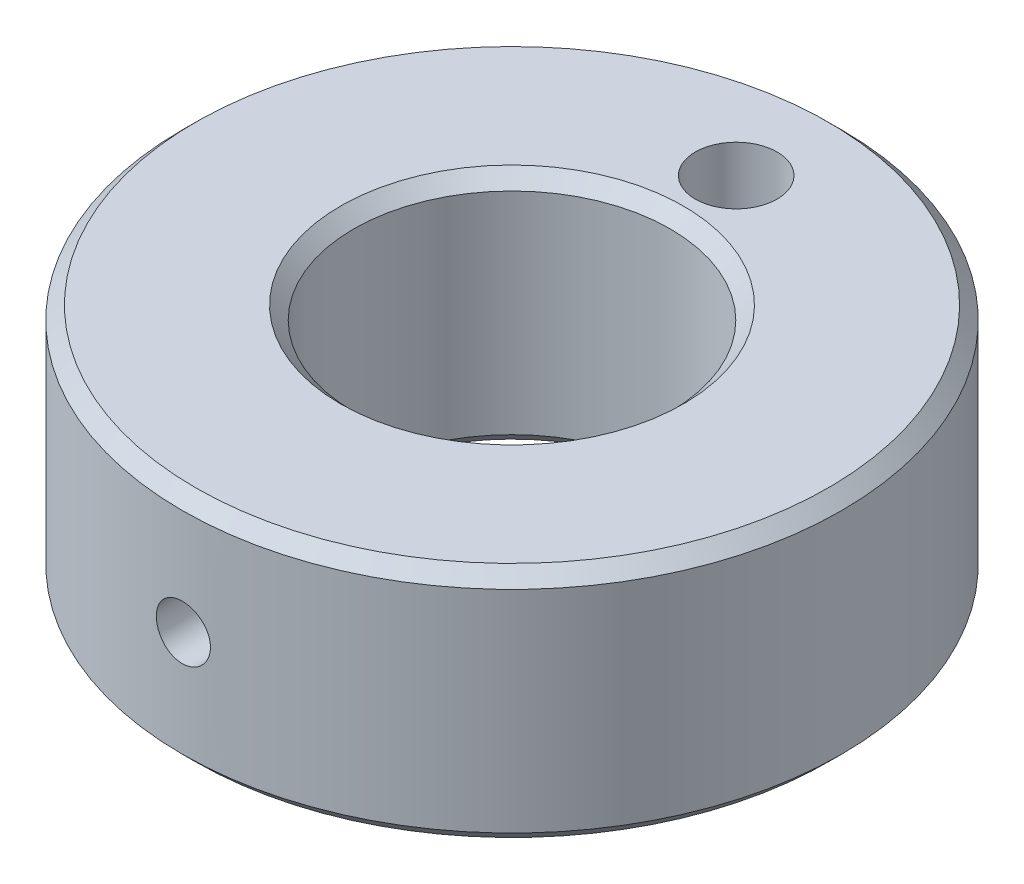
ISO-10303-21;
HEADER;
FILE_DESCRIPTION(('STEP AP214'),'2;1');
FILE_NAME('part.step','',(''),(''),'','','');
FILE_SCHEMA(('AUTOMOTIVE_DESIGN { 1 0 10303 214 1 1 1 1 }'));
ENDSEC;
DATA;
#1=APPLICATION_CONTEXT('core data for automotive mechanical design processes');
#2=APPLICATION_PROTOCOL_DEFINITION('international standard','automotive_design',2000,#1);
#3=PRODUCT_CONTEXT('',#1,'mechanical');
#4=PRODUCT('Part','Part','',(#3));
#5=PRODUCT_RELATED_PRODUCT_CATEGORY('part','',(#4));
#6=PRODUCT_DEFINITION_FORMATION('','',#4);
#7=PRODUCT_DEFINITION_CONTEXT('part definition',#1,'design');
#8=PRODUCT_DEFINITION('design','',#6,#7);
#9=PRODUCT_DEFINITION_SHAPE('','',#8);
#10=(LENGTH_UNIT() NAMED_UNIT(*) SI_UNIT(.MILLI.,.METRE.));
#11=(NAMED_UNIT(*) PLANE_ANGLE_UNIT() SI_UNIT($,.RADIAN.));
#12=(NAMED_UNIT(*) SI_UNIT($,.STERADIAN.) SOLID_ANGLE_UNIT());
#13=UNCERTAINTY_MEASURE_WITH_UNIT(LENGTH_MEASURE(1.E-05),#10,'distance_accuracy_value','');
#14=(GEOMETRIC_REPRESENTATION_CONTEXT(3) GLOBAL_UNCERTAINTY_ASSIGNED_CONTEXT((#13)) GLOBAL_UNIT_ASSIGNED_CONTEXT((#10,
#11,#12)) REPRESENTATION_CONTEXT('',''));
#15=CARTESIAN_POINT('',(0.,0.,0.));
#16=DIRECTION('',(0.,0.,1.));
#17=DIRECTION('',(1.,0.,0.));
#18=AXIS2_PLACEMENT_3D('',#15,#16,#17);
#19=CARTESIAN_POINT('',(0.,9.,0.));
#20=DIRECTION('',(0.,1.,0.));
#21=DIRECTION('',(0.,0.,1.));
#22=AXIS2_PLACEMENT_3D('',#19,#20,#21);
#23=PLANE('',#22);
#24=CARTESIAN_POINT('',(0.,9.,-8.5));
#25=DIRECTION('',(0.,1.,0.));
#26=DIRECTION('',(0.,0.,1.));
#27=AXIS2_PLACEMENT_3D('',#24,#25,#26);
#28=CIRCLE('',#27,1.55);
#29=CARTESIAN_POINT('',(0.,9.,-6.95));
#30=VERTEX_POINT('',#29);
#31=EDGE_CURVE('E63',#30,#30,#28,.T.);
#32=ORIENTED_EDGE('',*,*,#31,.F.);
#33=EDGE_LOOP('',(#32));
#34=FACE_BOUND('',#33,.T.);
#35=CARTESIAN_POINT('',(0.,9.,0.));
#36=DIRECTION('',(0.,1.,0.));
#37=DIRECTION('',(0.,0.,1.));
#38=AXIS2_PLACEMENT_3D('',#35,#36,#37);
#39=CIRCLE('',#38,6.50000000000001);
#40=CARTESIAN_POINT('',(0.,9.,6.50000000000001));
#41=VERTEX_POINT('',#40);
#42=EDGE_CURVE('E11',#41,#41,#39,.F.);
#43=ORIENTED_EDGE('',*,*,#42,.T.);
#44=EDGE_LOOP('',(#43));
#45=FACE_BOUND('',#44,.T.);
#46=CARTESIAN_POINT('',(0.,9.,0.));
#47=DIRECTION('',(0.,1.,0.));
#48=DIRECTION('',(0.,0.,1.));
#49=AXIS2_PLACEMENT_3D('',#46,#47,#48);
#50=CIRCLE('',#49,12.);
#51=CARTESIAN_POINT('',(0.,9.,12.));
#52=VERTEX_POINT('',#51);
#53=EDGE_CURVE('E49',#52,#52,#50,.T.);
#54=ORIENTED_EDGE('',*,*,#53,.T.);
#55=EDGE_LOOP('',(#54));
#56=FACE_BOUND('',#55,.T.);
#57=ADVANCED_FACE('F42',(#34,#45,#56),#23,.T.);
#58=CARTESIAN_POINT('',(0.,0.,0.));
#59=DIRECTION('',(0.,1.,0.));
#60=DIRECTION('',(0.,0.,1.));
#61=AXIS2_PLACEMENT_3D('',#58,#59,#60);
#62=PLANE('',#61);
#63=CARTESIAN_POINT('',(0.,0.,0.));
#64=DIRECTION('',(0.,1.,0.));
#65=DIRECTION('',(0.,0.,1.));
#66=AXIS2_PLACEMENT_3D('',#63,#64,#65);
#67=CIRCLE('',#66,6.5);
#68=CARTESIAN_POINT('',(0.,0.,6.5));
#69=VERTEX_POINT('',#68);
#70=EDGE_CURVE('E130',#69,#69,#67,.T.);
#71=ORIENTED_EDGE('',*,*,#70,.T.);
#72=EDGE_LOOP('',(#71));
#73=FACE_BOUND('',#72,.T.);
#74=CARTESIAN_POINT('',(0.,0.,0.));
#75=DIRECTION('',(0.,1.,0.));
#76=DIRECTION('',(0.,0.,1.));
#77=AXIS2_PLACEMENT_3D('',#74,#75,#76);
#78=CIRCLE('',#77,12.);
#79=CARTESIAN_POINT('',(0.,0.,12.));
#80=VERTEX_POINT('',#79);
#81=EDGE_CURVE('E136',#80,#80,#78,.F.);
#82=ORIENTED_EDGE('',*,*,#81,.T.);
#83=EDGE_LOOP('',(#82));
#84=FACE_BOUND('',#83,.T.);
#85=ADVANCED_FACE('F93',(#73,#84),#62,.F.);
#86=CARTESIAN_POINT('',(0.,9.,0.));
#87=DIRECTION('',(0.,-1.,0.));
#88=DIRECTION('',(0.,0.,-1.));
#89=AXIS2_PLACEMENT_3D('',#86,#87,#88);
#90=CYLINDRICAL_SURFACE('',#89,12.5);
#91=CARTESIAN_POINT('',(1.02499999999999,4.50000000000001,12.457904117467));
#92=CARTESIAN_POINT('',(1.02499748803659,4.44252923768061,12.4579046755874));
#93=CARTESIAN_POINT('',(1.02015024492621,4.38501926916881,12.4583060843747));
#94=CARTESIAN_POINT('',(1.00088489570387,4.27159032255661,12.459868346834));
#95=CARTESIAN_POINT('',(0.986455923557125,4.21567322599984,12.4610300627007));
#96=CARTESIAN_POINT('',(0.948447016894179,4.10708928714128,12.463980481196));
#97=CARTESIAN_POINT('',(0.924872244346381,4.05442063079178,12.4657688300924));
#98=CARTESIAN_POINT('',(0.869250061697745,3.95380058800745,12.4697705695876));
#99=CARTESIAN_POINT('',(0.837204472258332,3.90584819092618,12.4719838688224));
#100=CARTESIAN_POINT('',(0.765464032348409,3.81588983296292,12.4765923160778));
#101=CARTESIAN_POINT('',(0.725752453632445,3.77389723141584,12.4789878547134));
#102=CARTESIAN_POINT('',(0.63984265006064,3.69716522480346,12.483687282687));
#103=CARTESIAN_POINT('',(0.593644142897647,3.66242613557029,12.4859911680307));
#104=CARTESIAN_POINT('',(0.495992437660146,3.60114300532084,12.4902513859797));
#105=CARTESIAN_POINT('',(0.444531978823797,3.57461049695649,12.4922072278585));
#106=CARTESIAN_POINT('',(0.337867808386797,3.53056746048193,12.4955467843319));
#107=CARTESIAN_POINT('',(0.28266416047258,3.51305677891838,12.4969305086575));
#108=CARTESIAN_POINT('',(0.170213399107486,3.4875928432904,12.4989671935619));
#109=CARTESIAN_POINT('',(0.112971202631818,3.47961800950836,12.4996218039018));
#110=CARTESIAN_POINT('',(-0.00204273955899841,3.47338544040074,12.5001320924092));
#111=CARTESIAN_POINT('',(-0.0598144756886261,3.47512752952864,12.4999877850101));
#112=CARTESIAN_POINT('',(-0.174101258322397,3.48826169567366,12.4989178598958));
#113=CARTESIAN_POINT('',(-0.230618991785223,3.49963056649716,12.4979941210866));
#114=CARTESIAN_POINT('',(-0.340941316865535,3.53165949712912,12.4954714012056));
#115=CARTESIAN_POINT('',(-0.394745883359131,3.55231964295711,12.4938724138823));
#116=CARTESIAN_POINT('',(-0.498188452068122,3.60237055176716,12.4901758626451));
#117=CARTESIAN_POINT('',(-0.547821399186417,3.63177171675401,12.4880777053056));
#118=CARTESIAN_POINT('',(-0.641456656087967,3.69846251905984,12.4836186269201));
#119=CARTESIAN_POINT('',(-0.685458855314575,3.73575231122955,12.4812577007165));
#120=CARTESIAN_POINT('',(-0.766719222476191,3.81729265888459,12.4765302394767));
#121=CARTESIAN_POINT('',(-0.803957161082404,3.86156337743104,12.4741637083829));
#122=CARTESIAN_POINT('',(-0.870475694206722,3.95573859977181,12.4696987554834));
#123=CARTESIAN_POINT('',(-0.899756282463483,4.00564310799911,12.4676003338886));
#124=CARTESIAN_POINT('',(-0.949528127970764,4.10968341022951,12.4639087895095));
#125=CARTESIAN_POINT('',(-0.970018349714463,4.16381970184996,12.4623157262622));
#126=CARTESIAN_POINT('',(-1.00161291614754,4.27478012761068,12.4598164087817));
#127=CARTESIAN_POINT('',(-1.01271745181415,4.33160420703579,12.4589101405738));
#128=CARTESIAN_POINT('',(-1.02519984948027,4.44615020585159,12.4578892740534));
#129=CARTESIAN_POINT('',(-1.02660591499784,4.50386903223468,12.457772380231));
#130=CARTESIAN_POINT('',(-1.01972532438384,4.61872158213449,12.4583374378068));
#131=CARTESIAN_POINT('',(-1.01143875574694,4.67585531092814,12.4590193819939));
#132=CARTESIAN_POINT('',(-0.98543162828581,4.78783496875867,12.461103183415));
#133=CARTESIAN_POINT('',(-0.967724218839479,4.84268397197853,12.4625040371165));
#134=CARTESIAN_POINT('',(-0.923391422202269,4.94863241999835,12.4658669813908));
#135=CARTESIAN_POINT('',(-0.896765896384787,4.99973180649779,12.4678290806879));
#136=CARTESIAN_POINT('',(-0.835281250248031,5.0968595938439,12.472099000009));
#137=CARTESIAN_POINT('',(-0.800403328197875,5.14287605763247,12.4744076050318));
#138=CARTESIAN_POINT('',(-0.723431115260204,5.22841114384437,12.4791077503498));
#139=CARTESIAN_POINT('',(-0.681336704103144,5.26792965795177,12.4814992920268));
#140=CARTESIAN_POINT('',(-0.591004578114003,5.33944325465796,12.4861026684042));
#141=CARTESIAN_POINT('',(-0.5427523345424,5.37142001798386,12.4883140571549));
#142=CARTESIAN_POINT('',(-0.441546687080579,5.42681673951885,12.4923015364853));
#143=CARTESIAN_POINT('',(-0.388593328891328,5.45023678089912,12.494077631296));
#144=CARTESIAN_POINT('',(-0.279554370123788,5.48782375929719,12.4969923470561));
#145=CARTESIAN_POINT('',(-0.223472702912803,5.50200204388111,12.498131749527));
#146=CARTESIAN_POINT('',(-0.109715077102332,5.52074013031056,12.4996478699403));
#147=CARTESIAN_POINT('',(-0.0520391476464359,5.52530010786396,12.5000246018153));
#148=CARTESIAN_POINT('',(0.0630891663408579,5.52467011756891,12.4999729566683));
#149=CARTESIAN_POINT('',(0.12054171036302,5.51950870792601,12.4995469378594));
#150=CARTESIAN_POINT('',(0.233761093008734,5.49964198568827,12.4979423265381));
#151=CARTESIAN_POINT('',(0.289527929283921,5.48493665979841,12.4967637329771));
#152=CARTESIAN_POINT('',(0.397794896391851,5.44640674138726,12.4937862276187));
#153=CARTESIAN_POINT('',(0.450295201825881,5.42258263676691,12.49198734901));
#154=CARTESIAN_POINT('',(0.550555496222022,5.36649474563335,12.4879705749283));
#155=CARTESIAN_POINT('',(0.598315563577056,5.33423109872336,12.4857526863864));
#156=CARTESIAN_POINT('',(0.687885751752588,5.26207282065356,12.4811391148201));
#157=CARTESIAN_POINT('',(0.72967883870007,5.22215707618357,12.4787429513704));
#158=CARTESIAN_POINT('',(0.80598876545467,5.13586538663043,12.4740469730431));
#159=CARTESIAN_POINT('',(0.840503839359891,5.08948787821901,12.4717471816569));
#160=CARTESIAN_POINT('',(0.901323133549686,4.99150185919363,12.4674997759167));
#161=CARTESIAN_POINT('',(0.927612239536814,4.93988394764331,12.465552812574));
#162=CARTESIAN_POINT('',(0.97111678047144,4.8329861069217,12.4622394708506));
#163=CARTESIAN_POINT('',(0.988342661584624,4.77771047672113,12.4608724244183));
#164=CARTESIAN_POINT('',(1.00883800385066,4.68508986723023,12.4592257642811));
#165=CARTESIAN_POINT('',(1.01489071181459,4.64834080818518,12.4587324204337));
#166=CARTESIAN_POINT('',(1.0229725178438,4.574399976599,12.4580714167763));
#167=CARTESIAN_POINT('',(1.02500162631651,4.53720820520324,12.4579037561239));
#168=CARTESIAN_POINT('',(1.02499999999999,4.50000000000001,12.457904117467));
#169=B_SPLINE_CURVE_WITH_KNOTS('',3,(#91,#92,#93,#94,#95,#96,#97,#98,#99,#100,#101,#102,#103,
#104,#105,#106,#107,#108,#109,#110,#111,#112,#113,#114,#115,#116,#117,#118,#119,#120,#121,#122,
#123,#124,#125,#126,#127,#128,#129,#130,#131,#132,#133,#134,#135,#136,#137,#138,#139,#140,#141,
#142,#143,#144,#145,#146,#147,#148,#149,#150,#151,#152,#153,#154,#155,#156,#157,#158,#159,#160,
#161,#162,#163,#164,#165,#166,#167,#168),.UNSPECIFIED.,.T.,.F.,(4,2,2,2,2,2,2,2,2,2,2,2,2,2,2,2,
2,2,2,2,2,2,2,2,2,2,2,2,2,2,2,2,2,2,2,2,2,2,4),(0.,0.172276434326406,0.344748570893414,
0.517123503994385,0.68946141804833,0.862179737327143,1.03490557553237,1.20787305277124,
1.38083758788802,1.55340995725645,1.72597920893209,1.89813364781561,2.07028968055427,
2.2426514084292,2.41501652001302,2.58788891518234,2.76076144637813,2.9336543364023,
3.10654370836727,3.27893009873215,3.45131493299031,3.62345978555843,3.79560731413598,
3.96815089478142,4.14069735130672,4.31365871146281,4.48661839039291,4.65936529731986,
4.83210904846754,5.00434612721891,5.17658344590315,5.34881155030466,5.52103680596427,
5.69374428081055,5.86649361246722,6.03955851278973,6.21242350114785,6.32396045040315,
6.43549711115725),.UNSPECIFIED.);
#170=CARTESIAN_POINT('',(1.02499999999999,4.50000000000001,12.457904117467));
#171=VERTEX_POINT('',#170);
#172=EDGE_CURVE('E66',#171,#171,#169,.T.);
#173=ORIENTED_EDGE('',*,*,#172,.T.);
#174=EDGE_LOOP('',(#173));
#175=FACE_BOUND('',#174,.T.);
#176=CARTESIAN_POINT('',(0.,0.500000000000009,0.));
#177=DIRECTION('',(0.,1.,0.));
#178=DIRECTION('',(0.,0.,1.));
#179=AXIS2_PLACEMENT_3D('',#176,#177,#178);
#180=CIRCLE('',#179,12.5);
#181=CARTESIAN_POINT('',(0.,0.500000000000009,12.5));
#182=VERTEX_POINT('',#181);
#183=EDGE_CURVE('E141',#182,#182,#180,.T.);
#184=ORIENTED_EDGE('',*,*,#183,.T.);
#185=EDGE_LOOP('',(#184));
#186=FACE_BOUND('',#185,.T.);
#187=CARTESIAN_POINT('',(0.,8.5,0.));
#188=DIRECTION('',(0.,1.,0.));
#189=DIRECTION('',(0.,0.,1.));
#190=AXIS2_PLACEMENT_3D('',#187,#188,#189);
#191=CIRCLE('',#190,12.5);
#192=CARTESIAN_POINT('',(0.,8.5,12.5));
#193=VERTEX_POINT('',#192);
#194=EDGE_CURVE('E133',#193,#193,#191,.F.);
#195=ORIENTED_EDGE('',*,*,#194,.T.);
#196=EDGE_LOOP('',(#195));
#197=FACE_BOUND('',#196,.T.);
#198=ADVANCED_FACE('F99',(#175,#186,#197),#90,.T.);
#199=CARTESIAN_POINT('',(0.,9.,0.));
#200=DIRECTION('',(0.,-1.,0.));
#201=DIRECTION('',(0.,0.,-1.));
#202=AXIS2_PLACEMENT_3D('',#199,#200,#201);
#203=CYLINDRICAL_SURFACE('',#202,6.);
#204=CARTESIAN_POINT('',(1.02499999999999,4.50000000000001,5.91179964139517));
#205=CARTESIAN_POINT('',(1.02499772273755,4.44287783502228,5.9118006896228));
#206=CARTESIAN_POINT('',(1.02020878640849,4.38572500247462,5.91263652364019));
#207=CARTESIAN_POINT('',(1.00118876994721,4.27302446278079,5.91588628969574));
#208=CARTESIAN_POINT('',(0.986949115623023,4.21747826105562,5.91830165473889));
#209=CARTESIAN_POINT('',(0.949472278424441,4.10963825093531,5.92442911939884));
#210=CARTESIAN_POINT('',(0.926242779178084,4.05734170923323,5.92814011137788));
#211=CARTESIAN_POINT('',(0.871465034162875,3.95739354578229,5.93643938471199));
#212=CARTESIAN_POINT('',(0.839917669347548,3.9097414328689,5.94102757314817));
#213=CARTESIAN_POINT('',(0.769051458261803,3.81993631648982,5.95061732521301));
#214=CARTESIAN_POINT('',(0.729663308743944,3.77783836029365,5.95562232530027));
#215=CARTESIAN_POINT('',(0.644383390235817,3.70081497669635,5.96545127024846));
#216=CARTESIAN_POINT('',(0.598491228387675,3.6658899828716,5.97027520415027));
#217=CARTESIAN_POINT('',(0.501148354614963,3.60399646242411,5.97923494624524));
#218=CARTESIAN_POINT('',(0.449664533513418,3.5770792990045,5.98336624104806));
#219=CARTESIAN_POINT('',(0.342823647005743,3.53229580858039,5.99043693442385));
#220=CARTESIAN_POINT('',(0.287466846372922,3.51442886355135,5.99337641438114));
#221=CARTESIAN_POINT('',(0.175020457039517,3.48842171538393,5.99770801620039));
#222=CARTESIAN_POINT('',(0.117952851037856,3.48018895716333,5.99911485287263));
#223=CARTESIAN_POINT('',(0.00323014323703,3.47339596227158,6.00027324327979));
#224=CARTESIAN_POINT('',(-0.0544249164070402,3.47483503637258,6.00002491496401));
#225=CARTESIAN_POINT('',(-0.168052728482633,3.48727290442138,5.99791257505742));
#226=CARTESIAN_POINT('',(-0.224036742954671,3.49817208157792,5.9960654002019));
#227=CARTESIAN_POINT('',(-0.333369424650969,3.529063775313,5.99098170760679));
#228=CARTESIAN_POINT('',(-0.386718008404009,3.54905657970686,5.98774514589299));
#229=CARTESIAN_POINT('',(-0.489560315752141,3.59766622178188,5.98021777127519));
#230=CARTESIAN_POINT('',(-0.539034370140093,3.62632387199115,5.9759219873639));
#231=CARTESIAN_POINT('',(-0.632508888595246,3.69141978814529,5.96675302263621));
#232=CARTESIAN_POINT('',(-0.676508887308801,3.7278587148681,5.96187979279935));
#233=CARTESIAN_POINT('',(-0.758375188864932,3.80803466110825,5.95202418731771));
#234=CARTESIAN_POINT('',(-0.796156182560192,3.85185876537161,5.94704121216801));
#235=CARTESIAN_POINT('',(-0.863842810037644,3.94526828016719,5.93758765653871));
#236=CARTESIAN_POINT('',(-0.893748363860349,3.99485374918728,5.93311708126178));
#237=CARTESIAN_POINT('',(-0.94485340155782,4.09848007620809,5.92519407831867));
#238=CARTESIAN_POINT('',(-0.966042209773777,4.15252630079014,5.92174290058852));
#239=CARTESIAN_POINT('',(-0.999016325356516,4.26348315678278,5.91626981101407));
#240=CARTESIAN_POINT('',(-1.01080250539021,4.32039352184843,5.91424776653253));
#241=CARTESIAN_POINT('',(-1.02451583044538,4.43469875116292,5.91188766575082));
#242=CARTESIAN_POINT('',(-1.02656476627382,4.49207858816632,5.91152880817564));
#243=CARTESIAN_POINT('',(-1.02107036175863,4.60636115211301,5.91248025775676));
#244=CARTESIAN_POINT('',(-1.01352741152511,4.66326389836523,5.91379049702949));
#245=CARTESIAN_POINT('',(-0.989167330030116,4.77458757374756,5.91791326062162));
#246=CARTESIAN_POINT('',(-0.97241254461017,4.82902255287772,5.92071568185253));
#247=CARTESIAN_POINT('',(-0.930169932122551,4.93431218319463,5.92749852633021));
#248=CARTESIAN_POINT('',(-0.90468155897152,4.98516661026113,5.93147902323616));
#249=CARTESIAN_POINT('',(-0.845409216577014,5.08239255828241,5.94021766660985));
#250=CARTESIAN_POINT('',(-0.811547412208321,5.12871597412297,5.94498296074601));
#251=CARTESIAN_POINT('',(-0.736595890800804,5.21506686302564,5.95473351967587));
#252=CARTESIAN_POINT('',(-0.695505638593732,5.25509386950836,5.95971880073612));
#253=CARTESIAN_POINT('',(-0.606723193690897,5.32816241151444,5.96941361618125));
#254=CARTESIAN_POINT('',(-0.558963589998459,5.36112259257187,5.97411953024794));
#255=CARTESIAN_POINT('',(-0.458514267682294,5.41855120033378,5.98266677755162));
#256=CARTESIAN_POINT('',(-0.405824714760057,5.44301991231662,5.98650813983247));
#257=CARTESIAN_POINT('',(-0.297249597160217,5.48264531932086,5.99287776251716));
#258=CARTESIAN_POINT('',(-0.241379748484828,5.49784408348141,5.99541194697986));
#259=CARTESIAN_POINT('',(-0.127833634558961,5.51863340905155,5.9989067697464));
#260=CARTESIAN_POINT('',(-0.0701575262427178,5.52422480283831,5.99986754436924));
#261=CARTESIAN_POINT('',(0.0445796527234015,5.52561575242231,6.00010521773331));
#262=CARTESIAN_POINT('',(0.101639218476347,5.52153891351966,5.99940337266677));
#263=CARTESIAN_POINT('',(0.21424810568143,5.50397711910949,5.99643820675396));
#264=CARTESIAN_POINT('',(0.269797436652451,5.49049222291446,5.99417489575185));
#265=CARTESIAN_POINT('',(0.377758325666925,5.45454544730464,5.98834034657507));
#266=CARTESIAN_POINT('',(0.430173645267343,5.43209458836354,5.9847707145081));
#267=CARTESIAN_POINT('',(0.530512381474414,5.3788671335058,5.97671256974527));
#268=CARTESIAN_POINT('',(0.578435567676425,5.34809011084872,5.97222400995454));
#269=CARTESIAN_POINT('',(0.669051093069712,5.27864818893177,5.96275723858921));
#270=CARTESIAN_POINT('',(0.711673698735273,5.23989299711401,5.9577737938103));
#271=CARTESIAN_POINT('',(0.789854086881956,5.15578401032146,5.9479145235891));
#272=CARTESIAN_POINT('',(0.825410211969787,5.11042867163938,5.94303872363195));
#273=CARTESIAN_POINT('',(0.888693758575786,5.01400352900526,5.93390733510362));
#274=CARTESIAN_POINT('',(0.916360666196666,4.96289353909439,5.92965665568243));
#275=CARTESIAN_POINT('',(0.962673253963567,4.85669876015844,5.92231497537174));
#276=CARTESIAN_POINT('',(0.981327852266438,4.80161796275899,5.91922282873591));
#277=CARTESIAN_POINT('',(1.00508414328106,4.70527673783933,5.91522632721028));
#278=CARTESIAN_POINT('',(1.0125404543013,4.66459621314914,5.91394855626181));
#279=CARTESIAN_POINT('',(1.02249915739839,4.58261579872781,5.91223484256437));
#280=CARTESIAN_POINT('',(1.02500164712236,4.5413159212212,5.91179888322204));
#281=CARTESIAN_POINT('',(1.02499999999999,4.50000000000001,5.91179964139517));
#282=B_SPLINE_CURVE_WITH_KNOTS('',3,(#204,#205,#206,#207,#208,#209,#210,#211,#212,#213,#214,
#215,#216,#217,#218,#219,#220,#221,#222,#223,#224,#225,#226,#227,#228,#229,#230,#231,#232,#233,
#234,#235,#236,#237,#238,#239,#240,#241,#242,#243,#244,#245,#246,#247,#248,#249,#250,#251,#252,
#253,#254,#255,#256,#257,#258,#259,#260,#261,#262,#263,#264,#265,#266,#267,#268,#269,#270,#271,
#272,#273,#274,#275,#276,#277,#278,#279,#280,#281),.UNSPECIFIED.,.T.,.F.,(4,2,2,2,2,2,2,2,2,2,2,
2,2,2,2,2,2,2,2,2,2,2,2,2,2,2,2,2,2,2,2,2,2,2,2,2,2,2,4),(0.,0.171215389553426,
0.342586327507543,0.513811116913353,0.685017779008599,0.857810873427274,1.03061440941324,
1.20450354687646,1.37838080813483,1.55057355852007,1.72275403834729,1.89314312201172,
2.06353759890374,2.23474750002439,2.40597194589833,2.57937836537162,2.75278654537563,
2.92640647578851,3.10001029049429,3.27143689727893,3.44285653222128,3.61313002846461,
3.78341417330942,3.95534496803344,4.12728849725569,4.30111621257488,4.47493808743398,
4.64796513255631,4.82097718595661,4.99178928266892,5.1626003025172,5.33320201377504,
5.50381247053062,5.67647192165771,5.84917182117659,6.02316280979796,6.19698127066765,
6.32082218235195,6.4446606529247),.UNSPECIFIED.);
#283=CARTESIAN_POINT('',(1.02499999999999,4.50000000000001,5.91179964139517));
#284=VERTEX_POINT('',#283);
#285=EDGE_CURVE('E62',#284,#284,#282,.T.);
#286=ORIENTED_EDGE('',*,*,#285,.F.);
#287=EDGE_LOOP('',(#286));
#288=FACE_BOUND('',#287,.T.);
#289=CARTESIAN_POINT('',(0.,0.499999999999997,0.));
#290=DIRECTION('',(0.,1.,0.));
#291=DIRECTION('',(0.,0.,1.));
#292=AXIS2_PLACEMENT_3D('',#289,#290,#291);
#293=CIRCLE('',#292,6.);
#294=CARTESIAN_POINT('',(0.,0.499999999999997,6.));
#295=VERTEX_POINT('',#294);
#296=EDGE_CURVE('E129',#295,#295,#293,.F.);
#297=ORIENTED_EDGE('',*,*,#296,.T.);
#298=EDGE_LOOP('',(#297));
#299=FACE_BOUND('',#298,.T.);
#300=CARTESIAN_POINT('',(0.,8.49999999999999,0.));
#301=DIRECTION('',(0.,1.,0.));
#302=DIRECTION('',(0.,0.,1.));
#303=AXIS2_PLACEMENT_3D('',#300,#301,#302);
#304=CIRCLE('',#303,6.);
#305=CARTESIAN_POINT('',(0.,8.49999999999999,6.));
#306=VERTEX_POINT('',#305);
#307=EDGE_CURVE('E127',#306,#306,#304,.T.);
#308=ORIENTED_EDGE('',*,*,#307,.T.);
#309=EDGE_LOOP('',(#308));
#310=FACE_BOUND('',#309,.T.);
#311=ADVANCED_FACE('F104',(#288,#299,#310),#203,.F.);
#312=CARTESIAN_POINT('',(0.,0.,0.));
#313=DIRECTION('',(0.,-1.,0.));
#314=DIRECTION('',(0.,0.,-1.));
#315=AXIS2_PLACEMENT_3D('',#312,#313,#314);
#316=CONICAL_SURFACE('',#315,6.5,0.785398163397446);
#317=ORIENTED_EDGE('',*,*,#296,.F.);
#318=EDGE_LOOP('',(#317));
#319=FACE_BOUND('',#318,.T.);
#320=ORIENTED_EDGE('',*,*,#70,.F.);
#321=EDGE_LOOP('',(#320));
#322=FACE_BOUND('',#321,.T.);
#323=ADVANCED_FACE('F109',(#319,#322),#316,.F.);
#324=CARTESIAN_POINT('',(0.,0.500000000000009,0.));
#325=DIRECTION('',(0.,1.,0.));
#326=DIRECTION('',(0.,0.,1.));
#327=AXIS2_PLACEMENT_3D('',#324,#325,#326);
#328=CONICAL_SURFACE('',#327,12.5,0.785398163397452);
#329=ORIENTED_EDGE('',*,*,#81,.F.);
#330=EDGE_LOOP('',(#329));
#331=FACE_BOUND('',#330,.T.);
#332=ORIENTED_EDGE('',*,*,#183,.F.);
#333=EDGE_LOOP('',(#332));
#334=FACE_BOUND('',#333,.T.);
#335=ADVANCED_FACE('F112',(#331,#334),#328,.T.);
#336=CARTESIAN_POINT('',(0.,8.49999999999999,0.));
#337=DIRECTION('',(0.,1.,0.));
#338=DIRECTION('',(0.,0.,1.));
#339=AXIS2_PLACEMENT_3D('',#336,#337,#338);
#340=CONICAL_SURFACE('',#339,6.,0.785398163397452);
#341=ORIENTED_EDGE('',*,*,#42,.F.);
#342=EDGE_LOOP('',(#341));
#343=FACE_BOUND('',#342,.T.);
#344=ORIENTED_EDGE('',*,*,#307,.F.);
#345=EDGE_LOOP('',(#344));
#346=FACE_BOUND('',#345,.T.);
#347=ADVANCED_FACE('F115',(#343,#346),#340,.F.);
#348=CARTESIAN_POINT('',(0.,9.,0.));
#349=DIRECTION('',(0.,-1.,0.));
#350=DIRECTION('',(0.,0.,-1.));
#351=AXIS2_PLACEMENT_3D('',#348,#349,#350);
#352=CONICAL_SURFACE('',#351,12.,0.785398163397447);
#353=ORIENTED_EDGE('',*,*,#194,.F.);
#354=EDGE_LOOP('',(#353));
#355=FACE_BOUND('',#354,.T.);
#356=ORIENTED_EDGE('',*,*,#53,.F.);
#357=EDGE_LOOP('',(#356));
#358=FACE_BOUND('',#357,.T.);
#359=ADVANCED_FACE('F44',(#355,#358),#352,.T.);
#360=CARTESIAN_POINT('',(0.,4.50000000000001,12.5));
#361=DIRECTION('',(0.,0.,1.));
#362=DIRECTION('',(1.,0.,0.));
#363=AXIS2_PLACEMENT_3D('',#360,#361,#362);
#364=CYLINDRICAL_SURFACE('',#363,1.02499999999999);
#365=ORIENTED_EDGE('',*,*,#285,.T.);
#366=EDGE_LOOP('',(#365));
#367=FACE_BOUND('',#366,.T.);
#368=ORIENTED_EDGE('',*,*,#172,.F.);
#369=EDGE_LOOP('',(#368));
#370=FACE_BOUND('',#369,.T.);
#371=ADVANCED_FACE('F56',(#367,#370),#364,.F.);
#372=CARTESIAN_POINT('',(0.,6.,-8.5));
#373=DIRECTION('',(0.,1.,0.));
#374=DIRECTION('',(0.,0.,1.));
#375=AXIS2_PLACEMENT_3D('',#372,#373,#374);
#376=CONICAL_SURFACE('',#375,1.55,1.02974425867665);
#377=CARTESIAN_POINT('',(0.,5.06866604050728,-8.5));
#378=VERTEX_POINT('',#377);
#379=VERTEX_LOOP('',#378);
#380=FACE_BOUND('',#379,.T.);
#381=CARTESIAN_POINT('',(0.,6.,-8.5));
#382=DIRECTION('',(0.,1.,0.));
#383=DIRECTION('',(0.,0.,1.));
#384=AXIS2_PLACEMENT_3D('',#381,#382,#383);
#385=CIRCLE('',#384,1.55);
#386=CARTESIAN_POINT('',(0.,6.,-6.95));
#387=VERTEX_POINT('',#386);
#388=EDGE_CURVE('E60',#387,#387,#385,.T.);
#389=ORIENTED_EDGE('',*,*,#388,.T.);
#390=EDGE_LOOP('',(#389));
#391=FACE_BOUND('',#390,.T.);
#392=ADVANCED_FACE('F52',(#380,#391),#376,.F.);
#393=CARTESIAN_POINT('',(0.,9.,-8.5));
#394=DIRECTION('',(0.,1.,0.));
#395=DIRECTION('',(0.,0.,1.));
#396=AXIS2_PLACEMENT_3D('',#393,#394,#395);
#397=CYLINDRICAL_SURFACE('',#396,1.55);
#398=ORIENTED_EDGE('',*,*,#388,.F.);
#399=EDGE_LOOP('',(#398));
#400=FACE_BOUND('',#399,.T.);
#401=ORIENTED_EDGE('',*,*,#31,.T.);
#402=EDGE_LOOP('',(#401));
#403=FACE_BOUND('',#402,.T.);
#404=ADVANCED_FACE('F55',(#400,#403),#397,.F.);
#405=CLOSED_SHELL('',(#57,#85,#198,#311,#323,#335,#347,#359,#371,#392,#404));
#406=MANIFOLD_SOLID_BREP('B2',#405);
#407=ADVANCED_BREP_SHAPE_REPRESENTATION('',(#18,#406),#14);
#408=SHAPE_DEFINITION_REPRESENTATION(#9,#407);
ENDSEC;
END-ISO-10303-21;
